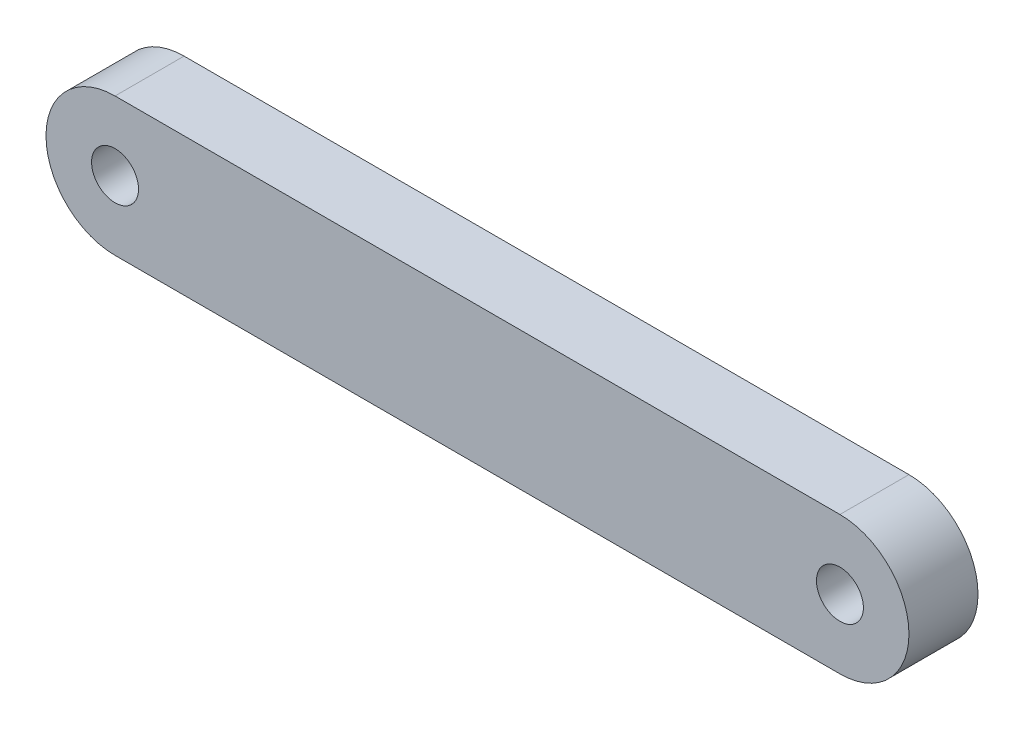
ISO-10303-21;
HEADER;
FILE_DESCRIPTION(('STEP AP214'),'2;1');
FILE_NAME('part.step','',(''),(''),'','','');
FILE_SCHEMA(('AUTOMOTIVE_DESIGN { 1 0 10303 214 1 1 1 1 }'));
ENDSEC;
DATA;
#1=APPLICATION_CONTEXT('core data for automotive mechanical design processes');
#2=APPLICATION_PROTOCOL_DEFINITION('international standard','automotive_design',2000,#1);
#3=PRODUCT_CONTEXT('',#1,'mechanical');
#4=PRODUCT('Part','Part','',(#3));
#5=PRODUCT_RELATED_PRODUCT_CATEGORY('part','',(#4));
#6=PRODUCT_DEFINITION_FORMATION('','',#4);
#7=PRODUCT_DEFINITION_CONTEXT('part definition',#1,'design');
#8=PRODUCT_DEFINITION('design','',#6,#7);
#9=PRODUCT_DEFINITION_SHAPE('','',#8);
#10=(LENGTH_UNIT() NAMED_UNIT(*) SI_UNIT(.MILLI.,.METRE.));
#11=(NAMED_UNIT(*) PLANE_ANGLE_UNIT() SI_UNIT($,.RADIAN.));
#12=(NAMED_UNIT(*) SI_UNIT($,.STERADIAN.) SOLID_ANGLE_UNIT());
#13=UNCERTAINTY_MEASURE_WITH_UNIT(LENGTH_MEASURE(1.E-05),#10,'distance_accuracy_value','');
#14=(GEOMETRIC_REPRESENTATION_CONTEXT(3) GLOBAL_UNCERTAINTY_ASSIGNED_CONTEXT((#13)) GLOBAL_UNIT_ASSIGNED_CONTEXT((#10,
#11,#12)) REPRESENTATION_CONTEXT('',''));
#15=CARTESIAN_POINT('',(0.,0.,0.));
#16=DIRECTION('',(0.,0.,1.));
#17=DIRECTION('',(1.,0.,0.));
#18=AXIS2_PLACEMENT_3D('',#15,#16,#17);
#19=CARTESIAN_POINT('',(0.,0.,6.35));
#20=DIRECTION('',(0.,0.,1.));
#21=DIRECTION('',(1.,0.,0.));
#22=AXIS2_PLACEMENT_3D('',#19,#20,#21);
#23=PLANE('',#22);
#24=CARTESIAN_POINT('',(0.,0.,6.35));
#25=DIRECTION('',(0.,0.,1.));
#26=DIRECTION('',(1.,0.,0.));
#27=AXIS2_PLACEMENT_3D('',#24,#25,#26);
#28=CIRCLE('',#27,2.159);
#29=CARTESIAN_POINT('',(2.159,0.,6.35));
#30=VERTEX_POINT('',#29);
#31=EDGE_CURVE('E100',#30,#30,#28,.T.);
#32=ORIENTED_EDGE('',*,*,#31,.F.);
#33=EDGE_LOOP('',(#32));
#34=FACE_BOUND('',#33,.T.);
#35=CARTESIAN_POINT('',(0.,0.,6.35));
#36=DIRECTION('',(0.,0.,1.));
#37=DIRECTION('',(1.,0.,0.));
#38=AXIS2_PLACEMENT_3D('',#35,#36,#37);
#39=CIRCLE('',#38,6.35);
#40=CARTESIAN_POINT('',(0.,6.35,6.35));
#41=VERTEX_POINT('',#40);
#42=CARTESIAN_POINT('',(0.,-6.35,6.35));
#43=VERTEX_POINT('',#42);
#44=EDGE_CURVE('E85',#41,#43,#39,.T.);
#45=ORIENTED_EDGE('',*,*,#44,.T.);
#46=DIRECTION('',(1.,0.,0.));
#47=VECTOR('',#46,1.);
#48=CARTESIAN_POINT('',(0.,-6.35,6.35));
#49=LINE('',#48,#47);
#50=CARTESIAN_POINT('',(66.675,-6.35,6.35));
#51=VERTEX_POINT('',#50);
#52=EDGE_CURVE('E80',#43,#51,#49,.T.);
#53=ORIENTED_EDGE('',*,*,#52,.T.);
#54=CARTESIAN_POINT('',(66.675,0.,6.35));
#55=DIRECTION('',(0.,0.,1.));
#56=DIRECTION('',(1.,0.,0.));
#57=AXIS2_PLACEMENT_3D('',#54,#55,#56);
#58=CIRCLE('',#57,6.35);
#59=CARTESIAN_POINT('',(66.675,6.35,6.35));
#60=VERTEX_POINT('',#59);
#61=EDGE_CURVE('E83',#51,#60,#58,.T.);
#62=ORIENTED_EDGE('',*,*,#61,.T.);
#63=DIRECTION('',(-1.,0.,0.));
#64=VECTOR('',#63,1.);
#65=CARTESIAN_POINT('',(0.,6.35,6.35));
#66=LINE('',#65,#64);
#67=EDGE_CURVE('E50',#60,#41,#66,.T.);
#68=ORIENTED_EDGE('',*,*,#67,.T.);
#69=EDGE_LOOP('',(#45,#53,#62,#68));
#70=FACE_BOUND('',#69,.T.);
#71=CARTESIAN_POINT('',(66.675,0.,6.35));
#72=DIRECTION('',(0.,0.,1.));
#73=DIRECTION('',(1.,0.,0.));
#74=AXIS2_PLACEMENT_3D('',#71,#72,#73);
#75=CIRCLE('',#74,2.15900000000001);
#76=CARTESIAN_POINT('',(68.834,0.,6.35));
#77=VERTEX_POINT('',#76);
#78=EDGE_CURVE('E115',#77,#77,#75,.T.);
#79=ORIENTED_EDGE('',*,*,#78,.F.);
#80=EDGE_LOOP('',(#79));
#81=FACE_BOUND('',#80,.T.);
#82=ADVANCED_FACE('F33',(#34,#70,#81),#23,.T.);
#83=CARTESIAN_POINT('',(0.,0.,0.));
#84=DIRECTION('',(0.,0.,1.));
#85=DIRECTION('',(1.,0.,0.));
#86=AXIS2_PLACEMENT_3D('',#83,#84,#85);
#87=PLANE('',#86);
#88=CARTESIAN_POINT('',(0.,0.,0.));
#89=DIRECTION('',(0.,0.,1.));
#90=DIRECTION('',(1.,0.,0.));
#91=AXIS2_PLACEMENT_3D('',#88,#89,#90);
#92=CIRCLE('',#91,6.35);
#93=CARTESIAN_POINT('',(0.,6.35,0.));
#94=VERTEX_POINT('',#93);
#95=CARTESIAN_POINT('',(0.,-6.35,0.));
#96=VERTEX_POINT('',#95);
#97=EDGE_CURVE('E97',#94,#96,#92,.T.);
#98=ORIENTED_EDGE('',*,*,#97,.F.);
#99=DIRECTION('',(-1.,0.,0.));
#100=VECTOR('',#99,1.);
#101=CARTESIAN_POINT('',(0.,6.35,0.));
#102=LINE('',#101,#100);
#103=CARTESIAN_POINT('',(66.675,6.35,0.));
#104=VERTEX_POINT('',#103);
#105=EDGE_CURVE('E73',#104,#94,#102,.T.);
#106=ORIENTED_EDGE('',*,*,#105,.F.);
#107=CARTESIAN_POINT('',(66.675,0.,0.));
#108=DIRECTION('',(0.,0.,1.));
#109=DIRECTION('',(1.,0.,0.));
#110=AXIS2_PLACEMENT_3D('',#107,#108,#109);
#111=CIRCLE('',#110,6.35);
#112=CARTESIAN_POINT('',(66.675,-6.35,0.));
#113=VERTEX_POINT('',#112);
#114=EDGE_CURVE('E67',#113,#104,#111,.T.);
#115=ORIENTED_EDGE('',*,*,#114,.F.);
#116=DIRECTION('',(1.,0.,0.));
#117=VECTOR('',#116,1.);
#118=CARTESIAN_POINT('',(0.,-6.35,0.));
#119=LINE('',#118,#117);
#120=EDGE_CURVE('E89',#96,#113,#119,.T.);
#121=ORIENTED_EDGE('',*,*,#120,.F.);
#122=EDGE_LOOP('',(#98,#106,#115,#121));
#123=FACE_BOUND('',#122,.T.);
#124=CARTESIAN_POINT('',(0.,0.,0.));
#125=DIRECTION('',(0.,0.,1.));
#126=DIRECTION('',(1.,0.,0.));
#127=AXIS2_PLACEMENT_3D('',#124,#125,#126);
#128=CIRCLE('',#127,2.159);
#129=CARTESIAN_POINT('',(2.159,0.,0.));
#130=VERTEX_POINT('',#129);
#131=EDGE_CURVE('E112',#130,#130,#128,.T.);
#132=ORIENTED_EDGE('',*,*,#131,.T.);
#133=EDGE_LOOP('',(#132));
#134=FACE_BOUND('',#133,.T.);
#135=CARTESIAN_POINT('',(66.675,0.,0.));
#136=DIRECTION('',(0.,0.,1.));
#137=DIRECTION('',(1.,0.,0.));
#138=AXIS2_PLACEMENT_3D('',#135,#136,#137);
#139=CIRCLE('',#138,2.15900000000001);
#140=CARTESIAN_POINT('',(68.834,0.,0.));
#141=VERTEX_POINT('',#140);
#142=EDGE_CURVE('E118',#141,#141,#139,.T.);
#143=ORIENTED_EDGE('',*,*,#142,.T.);
#144=EDGE_LOOP('',(#143));
#145=FACE_BOUND('',#144,.T.);
#146=ADVANCED_FACE('F108',(#123,#134,#145),#87,.F.);
#147=CARTESIAN_POINT('',(0.,0.,6.35));
#148=DIRECTION('',(0.,0.,-1.));
#149=DIRECTION('',(-1.,0.,0.));
#150=AXIS2_PLACEMENT_3D('',#147,#148,#149);
#151=CYLINDRICAL_SURFACE('',#150,6.35);
#152=ORIENTED_EDGE('',*,*,#97,.T.);
#153=DIRECTION('',(0.,0.,-1.));
#154=VECTOR('',#153,1.);
#155=CARTESIAN_POINT('',(0.,-6.35,6.35));
#156=LINE('',#155,#154);
#157=EDGE_CURVE('E11',#43,#96,#156,.T.);
#158=ORIENTED_EDGE('',*,*,#157,.F.);
#159=ORIENTED_EDGE('',*,*,#44,.F.);
#160=DIRECTION('',(0.,0.,-1.));
#161=VECTOR('',#160,1.);
#162=CARTESIAN_POINT('',(0.,6.35,6.35));
#163=LINE('',#162,#161);
#164=EDGE_CURVE('E93',#41,#94,#163,.T.);
#165=ORIENTED_EDGE('',*,*,#164,.T.);
#166=EDGE_LOOP('',(#152,#158,#159,#165));
#167=FACE_BOUND('',#166,.T.);
#168=ADVANCED_FACE('F35',(#167),#151,.T.);
#169=CARTESIAN_POINT('',(0.,-6.35,6.35));
#170=DIRECTION('',(0.,1.,0.));
#171=DIRECTION('',(0.,0.,1.));
#172=AXIS2_PLACEMENT_3D('',#169,#170,#171);
#173=PLANE('',#172);
#174=ORIENTED_EDGE('',*,*,#120,.T.);
#175=DIRECTION('',(0.,0.,-1.));
#176=VECTOR('',#175,1.);
#177=CARTESIAN_POINT('',(66.675,-6.35,6.35));
#178=LINE('',#177,#176);
#179=EDGE_CURVE('E42',#51,#113,#178,.T.);
#180=ORIENTED_EDGE('',*,*,#179,.F.);
#181=ORIENTED_EDGE('',*,*,#52,.F.);
#182=ORIENTED_EDGE('',*,*,#157,.T.);
#183=EDGE_LOOP('',(#174,#180,#181,#182));
#184=FACE_BOUND('',#183,.T.);
#185=ADVANCED_FACE('F88',(#184),#173,.F.);
#186=CARTESIAN_POINT('',(66.675,0.,6.35));
#187=DIRECTION('',(0.,0.,-1.));
#188=DIRECTION('',(-1.,0.,0.));
#189=AXIS2_PLACEMENT_3D('',#186,#187,#188);
#190=CYLINDRICAL_SURFACE('',#189,6.35);
#191=ORIENTED_EDGE('',*,*,#114,.T.);
#192=DIRECTION('',(0.,0.,-1.));
#193=VECTOR('',#192,1.);
#194=CARTESIAN_POINT('',(66.675,6.35,6.35));
#195=LINE('',#194,#193);
#196=EDGE_CURVE('E90',#60,#104,#195,.T.);
#197=ORIENTED_EDGE('',*,*,#196,.F.);
#198=ORIENTED_EDGE('',*,*,#61,.F.);
#199=ORIENTED_EDGE('',*,*,#179,.T.);
#200=EDGE_LOOP('',(#191,#197,#198,#199));
#201=FACE_BOUND('',#200,.T.);
#202=ADVANCED_FACE('F91',(#201),#190,.T.);
#203=CARTESIAN_POINT('',(0.,6.35,6.35));
#204=DIRECTION('',(0.,-1.,0.));
#205=DIRECTION('',(0.,0.,-1.));
#206=AXIS2_PLACEMENT_3D('',#203,#204,#205);
#207=PLANE('',#206);
#208=ORIENTED_EDGE('',*,*,#105,.T.);
#209=ORIENTED_EDGE('',*,*,#164,.F.);
#210=ORIENTED_EDGE('',*,*,#67,.F.);
#211=ORIENTED_EDGE('',*,*,#196,.T.);
#212=EDGE_LOOP('',(#208,#209,#210,#211));
#213=FACE_BOUND('',#212,.T.);
#214=ADVANCED_FACE('F105',(#213),#207,.F.);
#215=CARTESIAN_POINT('',(0.,0.,6.35));
#216=DIRECTION('',(0.,0.,-1.));
#217=DIRECTION('',(-1.,0.,0.));
#218=AXIS2_PLACEMENT_3D('',#215,#216,#217);
#219=CYLINDRICAL_SURFACE('',#218,2.159);
#220=ORIENTED_EDGE('',*,*,#31,.T.);
#221=EDGE_LOOP('',(#220));
#222=FACE_BOUND('',#221,.T.);
#223=ORIENTED_EDGE('',*,*,#131,.F.);
#224=EDGE_LOOP('',(#223));
#225=FACE_BOUND('',#224,.T.);
#226=ADVANCED_FACE('F135',(#222,#225),#219,.F.);
#227=CARTESIAN_POINT('',(66.675,0.,6.35));
#228=DIRECTION('',(0.,0.,-1.));
#229=DIRECTION('',(-1.,0.,0.));
#230=AXIS2_PLACEMENT_3D('',#227,#228,#229);
#231=CYLINDRICAL_SURFACE('',#230,2.15900000000001);
#232=ORIENTED_EDGE('',*,*,#78,.T.);
#233=EDGE_LOOP('',(#232));
#234=FACE_BOUND('',#233,.T.);
#235=ORIENTED_EDGE('',*,*,#142,.F.);
#236=EDGE_LOOP('',(#235));
#237=FACE_BOUND('',#236,.T.);
#238=ADVANCED_FACE('F124',(#234,#237),#231,.F.);
#239=CLOSED_SHELL('',(#82,#146,#168,#185,#202,#214,#226,#238));
#240=MANIFOLD_SOLID_BREP('B2',#239);
#241=ADVANCED_BREP_SHAPE_REPRESENTATION('',(#18,#240),#14);
#242=SHAPE_DEFINITION_REPRESENTATION(#9,#241);
ENDSEC;
END-ISO-10303-21;
